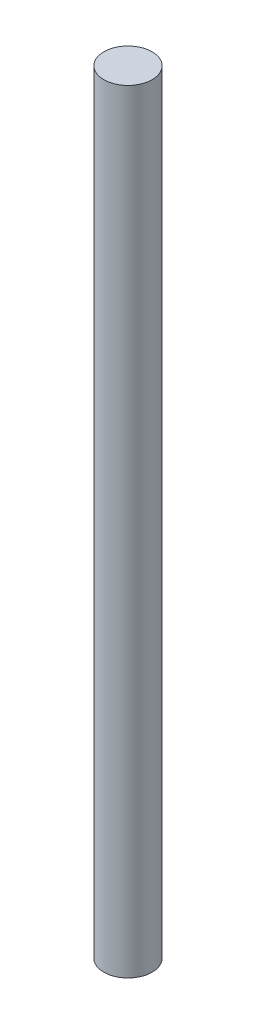
ISO-10303-21;
HEADER;
FILE_DESCRIPTION(('STEP AP214'),'2;1');
FILE_NAME('part.step','',(''),(''),'','','');
FILE_SCHEMA(('AUTOMOTIVE_DESIGN { 1 0 10303 214 1 1 1 1 }'));
ENDSEC;
DATA;
#1=APPLICATION_CONTEXT('core data for automotive mechanical design processes');
#2=APPLICATION_PROTOCOL_DEFINITION('international standard','automotive_design',2000,#1);
#3=PRODUCT_CONTEXT('',#1,'mechanical');
#4=PRODUCT('Part','Part','',(#3));
#5=PRODUCT_RELATED_PRODUCT_CATEGORY('part','',(#4));
#6=PRODUCT_DEFINITION_FORMATION('','',#4);
#7=PRODUCT_DEFINITION_CONTEXT('part definition',#1,'design');
#8=PRODUCT_DEFINITION('design','',#6,#7);
#9=PRODUCT_DEFINITION_SHAPE('','',#8);
#10=(LENGTH_UNIT() NAMED_UNIT(*) SI_UNIT(.MILLI.,.METRE.));
#11=(NAMED_UNIT(*) PLANE_ANGLE_UNIT() SI_UNIT($,.RADIAN.));
#12=(NAMED_UNIT(*) SI_UNIT($,.STERADIAN.) SOLID_ANGLE_UNIT());
#13=UNCERTAINTY_MEASURE_WITH_UNIT(LENGTH_MEASURE(1.E-05),#10,'distance_accuracy_value','');
#14=(GEOMETRIC_REPRESENTATION_CONTEXT(3) GLOBAL_UNCERTAINTY_ASSIGNED_CONTEXT((#13)) GLOBAL_UNIT_ASSIGNED_CONTEXT((#10,
#11,#12)) REPRESENTATION_CONTEXT('',''));
#15=CARTESIAN_POINT('',(0.,0.,0.));
#16=DIRECTION('',(0.,0.,1.));
#17=DIRECTION('',(1.,0.,0.));
#18=AXIS2_PLACEMENT_3D('',#15,#16,#17);
#19=CARTESIAN_POINT('',(0.,101.6,0.));
#20=DIRECTION('',(0.,-1.,0.));
#21=DIRECTION('',(0.,0.,-1.));
#22=AXIS2_PLACEMENT_3D('',#19,#20,#21);
#23=CYLINDRICAL_SURFACE('',#22,6.35);
#24=CARTESIAN_POINT('',(0.,101.6,0.));
#25=DIRECTION('',(0.,1.,0.));
#26=DIRECTION('',(0.,0.,1.));
#27=AXIS2_PLACEMENT_3D('',#24,#25,#26);
#28=CIRCLE('',#27,6.35);
#29=CARTESIAN_POINT('',(0.,101.6,6.35));
#30=VERTEX_POINT('',#29);
#31=EDGE_CURVE('E10',#30,#30,#28,.T.);
#32=ORIENTED_EDGE('',*,*,#31,.F.);
#33=EDGE_LOOP('',(#32));
#34=FACE_BOUND('',#33,.T.);
#35=CARTESIAN_POINT('',(0.,-101.6,0.));
#36=DIRECTION('',(0.,1.,0.));
#37=DIRECTION('',(0.,0.,1.));
#38=AXIS2_PLACEMENT_3D('',#35,#36,#37);
#39=CIRCLE('',#38,6.35);
#40=CARTESIAN_POINT('',(0.,-101.6,6.35));
#41=VERTEX_POINT('',#40);
#42=EDGE_CURVE('E35',#41,#41,#39,.T.);
#43=ORIENTED_EDGE('',*,*,#42,.T.);
#44=EDGE_LOOP('',(#43));
#45=FACE_BOUND('',#44,.T.);
#46=ADVANCED_FACE('F32',(#34,#45),#23,.T.);
#47=CARTESIAN_POINT('',(0.,101.6,0.));
#48=DIRECTION('',(0.,1.,0.));
#49=DIRECTION('',(0.,0.,1.));
#50=AXIS2_PLACEMENT_3D('',#47,#48,#49);
#51=PLANE('',#50);
#52=ORIENTED_EDGE('',*,*,#31,.T.);
#53=EDGE_LOOP('',(#52));
#54=FACE_BOUND('',#53,.T.);
#55=ADVANCED_FACE('F47',(#54),#51,.T.);
#56=CARTESIAN_POINT('',(0.,-101.6,0.));
#57=DIRECTION('',(0.,1.,0.));
#58=DIRECTION('',(0.,0.,1.));
#59=AXIS2_PLACEMENT_3D('',#56,#57,#58);
#60=PLANE('',#59);
#61=ORIENTED_EDGE('',*,*,#42,.F.);
#62=EDGE_LOOP('',(#61));
#63=FACE_BOUND('',#62,.T.);
#64=ADVANCED_FACE('F45',(#63),#60,.F.);
#65=CLOSED_SHELL('',(#46,#55,#64));
#66=MANIFOLD_SOLID_BREP('B2',#65);
#67=ADVANCED_BREP_SHAPE_REPRESENTATION('',(#18,#66),#14);
#68=SHAPE_DEFINITION_REPRESENTATION(#9,#67);
ENDSEC;
END-ISO-10303-21;
